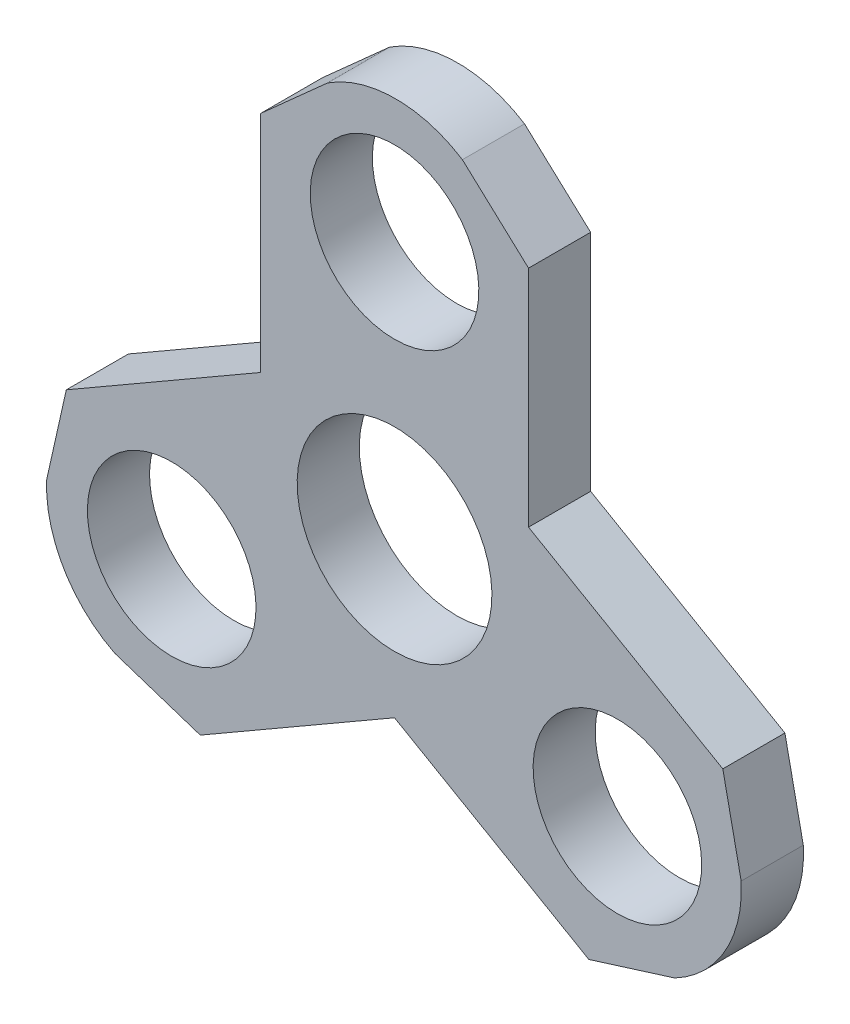
ISO-10303-21;
HEADER;
FILE_DESCRIPTION(('STEP AP214'),'2;1');
FILE_NAME('part.step','',(''),(''),'','','');
FILE_SCHEMA(('AUTOMOTIVE_DESIGN { 1 0 10303 214 1 1 1 1 }'));
ENDSEC;
DATA;
#1=APPLICATION_CONTEXT('core data for automotive mechanical design processes');
#2=APPLICATION_PROTOCOL_DEFINITION('international standard','automotive_design',2000,#1);
#3=PRODUCT_CONTEXT('',#1,'mechanical');
#4=PRODUCT('Part','Part','',(#3));
#5=PRODUCT_RELATED_PRODUCT_CATEGORY('part','',(#4));
#6=PRODUCT_DEFINITION_FORMATION('','',#4);
#7=PRODUCT_DEFINITION_CONTEXT('part definition',#1,'design');
#8=PRODUCT_DEFINITION('design','',#6,#7);
#9=PRODUCT_DEFINITION_SHAPE('','',#8);
#10=(LENGTH_UNIT() NAMED_UNIT(*) SI_UNIT(.MILLI.,.METRE.));
#11=(NAMED_UNIT(*) PLANE_ANGLE_UNIT() SI_UNIT($,.RADIAN.));
#12=(NAMED_UNIT(*) SI_UNIT($,.STERADIAN.) SOLID_ANGLE_UNIT());
#13=UNCERTAINTY_MEASURE_WITH_UNIT(LENGTH_MEASURE(1.E-05),#10,'distance_accuracy_value','');
#14=(GEOMETRIC_REPRESENTATION_CONTEXT(3) GLOBAL_UNCERTAINTY_ASSIGNED_CONTEXT((#13)) GLOBAL_UNIT_ASSIGNED_CONTEXT((#10,
#11,#12)) REPRESENTATION_CONTEXT('',''));
#15=CARTESIAN_POINT('',(0.,0.,0.));
#16=DIRECTION('',(0.,0.,1.));
#17=DIRECTION('',(1.,0.,0.));
#18=AXIS2_PLACEMENT_3D('',#15,#16,#17);
#19=CARTESIAN_POINT('',(-25.2223648236842,-17.3932095991333,-2.98513195330053));
#20=DIRECTION('',(0.,0.,-1.));
#21=DIRECTION('',(0.,1.,0.));
#22=AXIS2_PLACEMENT_3D('',#19,#20,#21);
#23=PLANE('',#22);
#24=DIRECTION('',(0.866025403784438,0.5,0.));
#25=VECTOR('',#24,1.);
#26=CARTESIAN_POINT('',(7.46668352147317E-12,-20.4211100828272,-2.98513195330054));
#27=LINE('',#26,#25);
#28=CARTESIAN_POINT('',(-21.8948637286672,-33.0621155504477,-2.98513195330058));
#29=VERTEX_POINT('',#28);
#30=CARTESIAN_POINT('',(7.46668352147317E-12,-20.4211100828272,-2.98513195330054));
#31=VERTEX_POINT('',#30);
#32=EDGE_CURVE('E203',#29,#31,#27,.T.);
#33=ORIENTED_EDGE('',*,*,#32,.T.);
#34=DIRECTION('',(0.866025403784439,-0.5,0.));
#35=VECTOR('',#34,1.);
#36=CARTESIAN_POINT('',(7.46668352147317E-12,-20.4211100828272,-2.98513195330054));
#37=LINE('',#36,#35);
#38=CARTESIAN_POINT('',(21.8948637286747,-33.0621155504433,-2.98513195330058));
#39=VERTEX_POINT('',#38);
#40=EDGE_CURVE('E116',#31,#39,#37,.T.);
#41=ORIENTED_EDGE('',*,*,#40,.T.);
#42=DIRECTION('',(0.954386697971061,0.298573325559894,0.));
#43=VECTOR('',#42,1.);
#44=CARTESIAN_POINT('',(21.8948637286747,-33.0621155504433,-2.98513195330058));
#45=LINE('',#44,#43);
#46=CARTESIAN_POINT('',(31.5628009791215,-30.0375677625216,-2.98513195330057));
#47=VERTEX_POINT('',#46);
#48=EDGE_CURVE('E239',#39,#47,#45,.T.);
#49=ORIENTED_EDGE('',*,*,#48,.T.);
#50=CARTESIAN_POINT('',(25.0889436728358,-17.6243018112157,-2.98513195330053));
#51=DIRECTION('',(0.,0.,1.));
#52=DIRECTION('',(0.,1.,0.));
#53=AXIS2_PLACEMENT_3D('',#50,#51,#52);
#54=CIRCLE('',#53,14.);
#55=CARTESIAN_POINT('',(39.0660590391427,-16.8241480529007,-2.98513195330052));
#56=VERTEX_POINT('',#55);
#57=EDGE_CURVE('E258',#47,#56,#54,.T.);
#58=ORIENTED_EDGE('',*,*,#57,.T.);
#59=DIRECTION('',(-0.204461531141964,0.97887459987635,0.));
#60=VECTOR('',#59,1.);
#61=CARTESIAN_POINT('',(36.9948637286747,-6.90814835615328,-2.98513195330049));
#62=LINE('',#61,#60);
#63=CARTESIAN_POINT('',(36.9948637286747,-6.90814835615328,-2.98513195330049));
#64=VERTEX_POINT('',#63);
#65=EDGE_CURVE('E255',#56,#64,#62,.T.);
#66=ORIENTED_EDGE('',*,*,#65,.T.);
#67=DIRECTION('',(-0.866025403784439,0.5,0.));
#68=VECTOR('',#67,1.);
#69=CARTESIAN_POINT('',(15.1,5.73285711146719,-2.98513195330045));
#70=LINE('',#69,#68);
#71=CARTESIAN_POINT('',(15.1,5.73285711146719,-2.98513195330045));
#72=VERTEX_POINT('',#71);
#73=EDGE_CURVE('E257',#64,#72,#70,.T.);
#74=ORIENTED_EDGE('',*,*,#73,.T.);
#75=DIRECTION('',(0.,1.,0.));
#76=VECTOR('',#75,1.);
#77=CARTESIAN_POINT('',(15.1,5.73285711146719,-2.98513195330045));
#78=LINE('',#77,#76);
#79=CARTESIAN_POINT('',(15.1,31.0148680466995,-2.98513195330036));
#80=VERTEX_POINT('',#79);
#81=EDGE_CURVE('E260',#72,#80,#78,.T.);
#82=ORIENTED_EDGE('',*,*,#81,.T.);
#83=DIRECTION('',(-0.735765433812801,0.677236462696938,0.));
#84=VECTOR('',#83,1.);
#85=CARTESIAN_POINT('',(15.1,31.0148680466995,-2.98513195330036));
#86=LINE('',#85,#84);
#87=CARTESIAN_POINT('',(7.64669615547633,37.8752734138195,-2.98513195330033));
#88=VERTEX_POINT('',#87);
#89=EDGE_CURVE('E266',#80,#88,#86,.T.);
#90=ORIENTED_EDGE('',*,*,#89,.T.);
#91=CARTESIAN_POINT('',(0.133421150855855,26.0621155504476,-2.98513195330037));
#92=DIRECTION('',(0.,0.,1.));
#93=DIRECTION('',(0.,1.,0.));
#94=AXIS2_PLACEMENT_3D('',#91,#92,#93);
#95=CIRCLE('',#94,14.);
#96=CARTESIAN_POINT('',(-7.548090013932,37.7665756501378,-2.98513195330033));
#97=VERTEX_POINT('',#96);
#98=EDGE_CURVE('E268',#88,#97,#95,.T.);
#99=ORIENTED_EDGE('',*,*,#98,.T.);
#100=DIRECTION('',(-0.745499505041264,-0.666506180003779,0.));
#101=VECTOR('',#100,1.);
#102=CARTESIAN_POINT('',(-15.1,31.0148680466995,-2.98513195330036));
#103=LINE('',#102,#101);
#104=CARTESIAN_POINT('',(-15.1,31.0148680466995,-2.98513195330036));
#105=VERTEX_POINT('',#104);
#106=EDGE_CURVE('E270',#97,#105,#103,.T.);
#107=ORIENTED_EDGE('',*,*,#106,.T.);
#108=DIRECTION('',(0.,-1.,0.));
#109=VECTOR('',#108,1.);
#110=CARTESIAN_POINT('',(-15.1,5.73285711145857,-2.98513195330045));
#111=LINE('',#110,#109);
#112=CARTESIAN_POINT('',(-15.1,5.73285711145857,-2.98513195330045));
#113=VERTEX_POINT('',#112);
#114=EDGE_CURVE('E272',#105,#113,#111,.T.);
#115=ORIENTED_EDGE('',*,*,#114,.T.);
#116=DIRECTION('',(-0.866025403784438,-0.5,0.));
#117=VECTOR('',#116,1.);
#118=CARTESIAN_POINT('',(-15.1,5.73285711145857,-2.98513195330045));
#119=LINE('',#118,#117);
#120=CARTESIAN_POINT('',(-36.9948637286672,-6.90814835615761,-2.98513195330049));
#121=VERTEX_POINT('',#120);
#122=EDGE_CURVE('E156',#113,#121,#119,.T.);
#123=ORIENTED_EDGE('',*,*,#122,.T.);
#124=DIRECTION('',(-0.21862126415826,-0.975809788256833,0.));
#125=VECTOR('',#124,1.);
#126=CARTESIAN_POINT('',(-36.9948637286672,-6.90814835615761,-2.98513195330049));
#127=LINE('',#126,#125);
#128=CARTESIAN_POINT('',(-39.2094971345904,-16.7931015111993,-2.98513195330052));
#129=VERTEX_POINT('',#128);
#130=EDGE_CURVE('E150',#121,#129,#127,.T.);
#131=ORIENTED_EDGE('',*,*,#130,.T.);
#132=CARTESIAN_POINT('',(-25.2223648236842,-17.3932095991333,-2.98513195330053));
#133=DIRECTION('',(0.,0.,1.));
#134=DIRECTION('',(0.,1.,0.));
#135=AXIS2_PLACEMENT_3D('',#132,#133,#134);
#136=CIRCLE('',#135,14.);
#137=CARTESIAN_POINT('',(-31.5179690252033,-29.8978234571385,-2.98513195330057));
#138=VERTEX_POINT('',#137);
#139=EDGE_CURVE('E154',#129,#138,#136,.T.);
#140=ORIENTED_EDGE('',*,*,#139,.T.);
#141=DIRECTION('',(0.949961036183229,-0.31236841987257,0.));
#142=VECTOR('',#141,1.);
#143=CARTESIAN_POINT('',(-21.8948637286672,-33.0621155504477,-2.98513195330058));
#144=LINE('',#143,#142);
#145=EDGE_CURVE('E52',#138,#29,#144,.T.);
#146=ORIENTED_EDGE('',*,*,#145,.T.);
#147=EDGE_LOOP('',(#33,#41,#49,#58,#66,#74,#82,#90,#99,#107,#115,#123,#131,#140,#146));
#148=FACE_BOUND('',#147,.T.);
#149=CARTESIAN_POINT('',(0.,-2.98513195330047,-2.98513195330048));
#150=DIRECTION('',(0.,0.,1.));
#151=DIRECTION('',(0.,-1.,0.));
#152=AXIS2_PLACEMENT_3D('',#149,#150,#151);
#153=CIRCLE('',#152,10.975);
#154=CARTESIAN_POINT('',(0.,-13.9601319533005,-2.98513195330051));
#155=VERTEX_POINT('',#154);
#156=EDGE_CURVE('E178',#155,#155,#153,.T.);
#157=ORIENTED_EDGE('',*,*,#156,.F.);
#158=EDGE_LOOP('',(#157));
#159=FACE_BOUND('',#158,.T.);
#160=CARTESIAN_POINT('',(0.,26.0148680466995,-2.98513195330037));
#161=DIRECTION('',(0.,0.,1.));
#162=DIRECTION('',(0.,-1.,0.));
#163=AXIS2_PLACEMENT_3D('',#160,#161,#162);
#164=CIRCLE('',#163,9.5);
#165=CARTESIAN_POINT('',(0.,16.5148680466995,-2.98513195330041));
#166=VERTEX_POINT('',#165);
#167=EDGE_CURVE('E336',#166,#166,#164,.T.);
#168=ORIENTED_EDGE('',*,*,#167,.F.);
#169=EDGE_LOOP('',(#168));
#170=FACE_BOUND('',#169,.T.);
#171=CARTESIAN_POINT('',(25.1147367097525,-17.4851319532983,-2.98513195330053));
#172=DIRECTION('',(0.,0.,1.));
#173=DIRECTION('',(0.,-1.,0.));
#174=AXIS2_PLACEMENT_3D('',#171,#172,#173);
#175=CIRCLE('',#174,9.5);
#176=CARTESIAN_POINT('',(25.1147367097525,-26.9851319532983,-2.98513195330056));
#177=VERTEX_POINT('',#176);
#178=EDGE_CURVE('E330',#177,#177,#175,.T.);
#179=ORIENTED_EDGE('',*,*,#178,.F.);
#180=EDGE_LOOP('',(#179));
#181=FACE_BOUND('',#180,.T.);
#182=CARTESIAN_POINT('',(-25.114736709745,-17.4851319533026,-2.98513195330053));
#183=DIRECTION('',(0.,0.,1.));
#184=DIRECTION('',(0.,-1.,0.));
#185=AXIS2_PLACEMENT_3D('',#182,#183,#184);
#186=CIRCLE('',#185,9.5);
#187=CARTESIAN_POINT('',(-25.114736709745,-26.9851319533026,-2.98513195330056));
#188=VERTEX_POINT('',#187);
#189=EDGE_CURVE('E321',#188,#188,#186,.T.);
#190=ORIENTED_EDGE('',*,*,#189,.F.);
#191=EDGE_LOOP('',(#190));
#192=FACE_BOUND('',#191,.T.);
#193=ADVANCED_FACE('F35',(#148,#159,#170,#181,#192),#23,.F.);
#194=CARTESIAN_POINT('',(-25.2223648236842,-17.3932095991333,-9.98513195330053));
#195=DIRECTION('',(0.,0.,-1.));
#196=DIRECTION('',(0.,1.,0.));
#197=AXIS2_PLACEMENT_3D('',#194,#195,#196);
#198=PLANE('',#197);
#199=CARTESIAN_POINT('',(25.1147367097525,-17.4851319532983,-9.98513195330053));
#200=DIRECTION('',(0.,0.,1.));
#201=DIRECTION('',(0.,-1.,0.));
#202=AXIS2_PLACEMENT_3D('',#199,#200,#201);
#203=CIRCLE('',#202,9.5);
#204=CARTESIAN_POINT('',(25.1147367097525,-26.9851319532983,-9.98513195330056));
#205=VERTEX_POINT('',#204);
#206=EDGE_CURVE('E327',#205,#205,#203,.T.);
#207=ORIENTED_EDGE('',*,*,#206,.T.);
#208=EDGE_LOOP('',(#207));
#209=FACE_BOUND('',#208,.T.);
#210=CARTESIAN_POINT('',(0.,-2.98513195330044,-9.98513195330048));
#211=DIRECTION('',(0.,0.,1.));
#212=DIRECTION('',(0.,-1.,0.));
#213=AXIS2_PLACEMENT_3D('',#210,#211,#212);
#214=CIRCLE('',#213,10.975);
#215=CARTESIAN_POINT('',(0.,-13.9601319533004,-9.98513195330051));
#216=VERTEX_POINT('',#215);
#217=EDGE_CURVE('E339',#216,#216,#214,.T.);
#218=ORIENTED_EDGE('',*,*,#217,.T.);
#219=EDGE_LOOP('',(#218));
#220=FACE_BOUND('',#219,.T.);
#221=DIRECTION('',(0.866025403784438,0.5,0.));
#222=VECTOR('',#221,1.);
#223=CARTESIAN_POINT('',(7.46668352147317E-12,-20.4211100828271,-9.98513195330054));
#224=LINE('',#223,#222);
#225=CARTESIAN_POINT('',(-21.8948637286672,-33.0621155504476,-9.98513195330058));
#226=VERTEX_POINT('',#225);
#227=CARTESIAN_POINT('',(7.46668352147317E-12,-20.4211100828271,-9.98513195330054));
#228=VERTEX_POINT('',#227);
#229=EDGE_CURVE('E174',#226,#228,#224,.T.);
#230=ORIENTED_EDGE('',*,*,#229,.F.);
#231=DIRECTION('',(0.949961036183229,-0.31236841987257,0.));
#232=VECTOR('',#231,1.);
#233=CARTESIAN_POINT('',(-21.8948637286672,-33.0621155504476,-9.98513195330058));
#234=LINE('',#233,#232);
#235=CARTESIAN_POINT('',(-31.5179690252033,-29.8978234571385,-9.98513195330057));
#236=VERTEX_POINT('',#235);
#237=EDGE_CURVE('E108',#236,#226,#234,.T.);
#238=ORIENTED_EDGE('',*,*,#237,.F.);
#239=CARTESIAN_POINT('',(-25.2223648236842,-17.3932095991333,-9.98513195330053));
#240=DIRECTION('',(0.,0.,1.));
#241=DIRECTION('',(0.,1.,0.));
#242=AXIS2_PLACEMENT_3D('',#239,#240,#241);
#243=CIRCLE('',#242,14.);
#244=CARTESIAN_POINT('',(-39.2094971345904,-16.7931015111993,-9.98513195330053));
#245=VERTEX_POINT('',#244);
#246=EDGE_CURVE('E102',#245,#236,#243,.T.);
#247=ORIENTED_EDGE('',*,*,#246,.F.);
#248=DIRECTION('',(-0.21862126415826,-0.975809788256833,0.));
#249=VECTOR('',#248,1.);
#250=CARTESIAN_POINT('',(-36.9948637286672,-6.90814835615759,-9.98513195330049));
#251=LINE('',#250,#249);
#252=CARTESIAN_POINT('',(-36.9948637286672,-6.90814835615759,-9.98513195330049));
#253=VERTEX_POINT('',#252);
#254=EDGE_CURVE('E164',#253,#245,#251,.T.);
#255=ORIENTED_EDGE('',*,*,#254,.F.);
#256=DIRECTION('',(-0.866025403784438,-0.5,0.));
#257=VECTOR('',#256,1.);
#258=CARTESIAN_POINT('',(-15.1,5.7328571114586,-9.98513195330045));
#259=LINE('',#258,#257);
#260=CARTESIAN_POINT('',(-15.1,5.7328571114586,-9.98513195330045));
#261=VERTEX_POINT('',#260);
#262=EDGE_CURVE('E198',#261,#253,#259,.T.);
#263=ORIENTED_EDGE('',*,*,#262,.F.);
#264=DIRECTION('',(0.,-1.,0.));
#265=VECTOR('',#264,1.);
#266=CARTESIAN_POINT('',(-15.1,5.7328571114586,-9.98513195330045));
#267=LINE('',#266,#265);
#268=CARTESIAN_POINT('',(-15.1,31.0148680466996,-9.98513195330036));
#269=VERTEX_POINT('',#268);
#270=EDGE_CURVE('E196',#269,#261,#267,.T.);
#271=ORIENTED_EDGE('',*,*,#270,.F.);
#272=DIRECTION('',(-0.745499505041264,-0.666506180003779,0.));
#273=VECTOR('',#272,1.);
#274=CARTESIAN_POINT('',(-15.1,31.0148680466996,-9.98513195330036));
#275=LINE('',#274,#273);
#276=CARTESIAN_POINT('',(-7.548090013932,37.7665756501378,-9.98513195330033));
#277=VERTEX_POINT('',#276);
#278=EDGE_CURVE('E194',#277,#269,#275,.T.);
#279=ORIENTED_EDGE('',*,*,#278,.F.);
#280=CARTESIAN_POINT('',(0.133421150855855,26.0621155504477,-9.98513195330038));
#281=DIRECTION('',(0.,0.,1.));
#282=DIRECTION('',(0.,1.,0.));
#283=AXIS2_PLACEMENT_3D('',#280,#281,#282);
#284=CIRCLE('',#283,14.);
#285=CARTESIAN_POINT('',(7.64669615547633,37.8752734138195,-9.98513195330033));
#286=VERTEX_POINT('',#285);
#287=EDGE_CURVE('E192',#286,#277,#284,.T.);
#288=ORIENTED_EDGE('',*,*,#287,.F.);
#289=DIRECTION('',(-0.735765433812801,0.677236462696938,0.));
#290=VECTOR('',#289,1.);
#291=CARTESIAN_POINT('',(15.1,31.0148680466996,-9.98513195330036));
#292=LINE('',#291,#290);
#293=CARTESIAN_POINT('',(15.1,31.0148680466996,-9.98513195330036));
#294=VERTEX_POINT('',#293);
#295=EDGE_CURVE('E190',#294,#286,#292,.T.);
#296=ORIENTED_EDGE('',*,*,#295,.F.);
#297=DIRECTION('',(0.,1.,0.));
#298=VECTOR('',#297,1.);
#299=CARTESIAN_POINT('',(15.1,5.73285711146722,-9.98513195330045));
#300=LINE('',#299,#298);
#301=CARTESIAN_POINT('',(15.1,5.73285711146722,-9.98513195330045));
#302=VERTEX_POINT('',#301);
#303=EDGE_CURVE('E188',#302,#294,#300,.T.);
#304=ORIENTED_EDGE('',*,*,#303,.F.);
#305=DIRECTION('',(-0.866025403784439,0.5,0.));
#306=VECTOR('',#305,1.);
#307=CARTESIAN_POINT('',(15.1,5.73285711146722,-9.98513195330045));
#308=LINE('',#307,#306);
#309=CARTESIAN_POINT('',(36.9948637286747,-6.90814835615325,-9.98513195330049));
#310=VERTEX_POINT('',#309);
#311=EDGE_CURVE('E186',#310,#302,#308,.T.);
#312=ORIENTED_EDGE('',*,*,#311,.F.);
#313=DIRECTION('',(-0.204461531141964,0.97887459987635,0.));
#314=VECTOR('',#313,1.);
#315=CARTESIAN_POINT('',(36.9948637286747,-6.90814835615325,-9.98513195330049));
#316=LINE('',#315,#314);
#317=CARTESIAN_POINT('',(39.0660590391427,-16.8241480529007,-9.98513195330053));
#318=VERTEX_POINT('',#317);
#319=EDGE_CURVE('E184',#318,#310,#316,.T.);
#320=ORIENTED_EDGE('',*,*,#319,.F.);
#321=CARTESIAN_POINT('',(25.0889436728358,-17.6243018112157,-9.98513195330053));
#322=DIRECTION('',(0.,0.,1.));
#323=DIRECTION('',(0.,1.,0.));
#324=AXIS2_PLACEMENT_3D('',#321,#322,#323);
#325=CIRCLE('',#324,14.);
#326=CARTESIAN_POINT('',(31.5628009791215,-30.0375677625216,-9.98513195330057));
#327=VERTEX_POINT('',#326);
#328=EDGE_CURVE('E182',#327,#318,#325,.T.);
#329=ORIENTED_EDGE('',*,*,#328,.F.);
#330=DIRECTION('',(0.954386697971061,0.298573325559894,0.));
#331=VECTOR('',#330,1.);
#332=CARTESIAN_POINT('',(21.8948637286747,-33.0621155504433,-9.98513195330058));
#333=LINE('',#332,#331);
#334=CARTESIAN_POINT('',(21.8948637286747,-33.0621155504433,-9.98513195330058));
#335=VERTEX_POINT('',#334);
#336=EDGE_CURVE('E180',#335,#327,#333,.T.);
#337=ORIENTED_EDGE('',*,*,#336,.F.);
#338=DIRECTION('',(0.866025403784439,-0.5,0.));
#339=VECTOR('',#338,1.);
#340=CARTESIAN_POINT('',(7.46668352147317E-12,-20.4211100828271,-9.98513195330054));
#341=LINE('',#340,#339);
#342=EDGE_CURVE('E177',#228,#335,#341,.T.);
#343=ORIENTED_EDGE('',*,*,#342,.F.);
#344=EDGE_LOOP('',(#230,#238,#247,#255,#263,#271,#279,#288,#296,#304,#312,#320,#329,#337,#343));
#345=FACE_BOUND('',#344,.T.);
#346=CARTESIAN_POINT('',(0.,26.0148680466996,-9.98513195330038));
#347=DIRECTION('',(0.,0.,1.));
#348=DIRECTION('',(0.,-1.,0.));
#349=AXIS2_PLACEMENT_3D('',#346,#347,#348);
#350=CIRCLE('',#349,9.5);
#351=CARTESIAN_POINT('',(0.,16.5148680466996,-9.98513195330041));
#352=VERTEX_POINT('',#351);
#353=EDGE_CURVE('E333',#352,#352,#350,.T.);
#354=ORIENTED_EDGE('',*,*,#353,.T.);
#355=EDGE_LOOP('',(#354));
#356=FACE_BOUND('',#355,.T.);
#357=CARTESIAN_POINT('',(-25.114736709745,-17.4851319533026,-9.98513195330053));
#358=DIRECTION('',(0.,0.,1.));
#359=DIRECTION('',(0.,-1.,0.));
#360=AXIS2_PLACEMENT_3D('',#357,#358,#359);
#361=CIRCLE('',#360,9.5);
#362=CARTESIAN_POINT('',(-25.114736709745,-26.9851319533026,-9.98513195330056));
#363=VERTEX_POINT('',#362);
#364=EDGE_CURVE('E324',#363,#363,#361,.T.);
#365=ORIENTED_EDGE('',*,*,#364,.T.);
#366=EDGE_LOOP('',(#365));
#367=FACE_BOUND('',#366,.T.);
#368=ADVANCED_FACE('F243',(#209,#220,#345,#356,#367),#198,.T.);
#369=CARTESIAN_POINT('',(7.46668352147317E-12,-20.4211100828272,-2.98513195330054));
#370=DIRECTION('',(-0.5,0.866025403784438,0.));
#371=DIRECTION('',(-0.866025403784438,-0.5,0.));
#372=AXIS2_PLACEMENT_3D('',#369,#370,#371);
#373=PLANE('',#372);
#374=ORIENTED_EDGE('',*,*,#229,.T.);
#375=DIRECTION('',(0.,0.,-1.));
#376=VECTOR('',#375,1.);
#377=CARTESIAN_POINT('',(7.46668352147317E-12,-20.4211100828272,-2.98513195330054));
#378=LINE('',#377,#376);
#379=EDGE_CURVE('E11',#31,#228,#378,.T.);
#380=ORIENTED_EDGE('',*,*,#379,.F.);
#381=ORIENTED_EDGE('',*,*,#32,.F.);
#382=DIRECTION('',(0.,0.,-1.));
#383=VECTOR('',#382,1.);
#384=CARTESIAN_POINT('',(-21.8948637286672,-33.0621155504477,-2.98513195330058));
#385=LINE('',#384,#383);
#386=EDGE_CURVE('E170',#29,#226,#385,.T.);
#387=ORIENTED_EDGE('',*,*,#386,.T.);
#388=EDGE_LOOP('',(#374,#380,#381,#387));
#389=FACE_BOUND('',#388,.T.);
#390=ADVANCED_FACE('F37',(#389),#373,.F.);
#391=CARTESIAN_POINT('',(7.46668352147317E-12,-20.4211100828272,-2.98513195330054));
#392=DIRECTION('',(0.5,0.866025403784439,0.));
#393=DIRECTION('',(-0.866025403784439,0.5,0.));
#394=AXIS2_PLACEMENT_3D('',#391,#392,#393);
#395=PLANE('',#394);
#396=ORIENTED_EDGE('',*,*,#342,.T.);
#397=DIRECTION('',(0.,0.,-1.));
#398=VECTOR('',#397,1.);
#399=CARTESIAN_POINT('',(21.8948637286747,-33.0621155504433,-2.98513195330058));
#400=LINE('',#399,#398);
#401=EDGE_CURVE('E44',#39,#335,#400,.T.);
#402=ORIENTED_EDGE('',*,*,#401,.F.);
#403=ORIENTED_EDGE('',*,*,#40,.F.);
#404=ORIENTED_EDGE('',*,*,#379,.T.);
#405=EDGE_LOOP('',(#396,#402,#403,#404));
#406=FACE_BOUND('',#405,.T.);
#407=ADVANCED_FACE('F482',(#406),#395,.F.);
#408=CARTESIAN_POINT('',(21.8948637286747,-33.0621155504433,-2.98513195330058));
#409=DIRECTION('',(-0.298573325559894,0.954386697971061,0.));
#410=DIRECTION('',(-0.954386697971061,-0.298573325559894,0.));
#411=AXIS2_PLACEMENT_3D('',#408,#409,#410);
#412=PLANE('',#411);
#413=ORIENTED_EDGE('',*,*,#336,.T.);
#414=DIRECTION('',(0.,0.,-1.));
#415=VECTOR('',#414,1.);
#416=CARTESIAN_POINT('',(31.5628009791215,-30.0375677625216,-2.98513195330057));
#417=LINE('',#416,#415);
#418=EDGE_CURVE('E231',#47,#327,#417,.T.);
#419=ORIENTED_EDGE('',*,*,#418,.F.);
#420=ORIENTED_EDGE('',*,*,#48,.F.);
#421=ORIENTED_EDGE('',*,*,#401,.T.);
#422=EDGE_LOOP('',(#413,#419,#420,#421));
#423=FACE_BOUND('',#422,.T.);
#424=ADVANCED_FACE('F237',(#423),#412,.F.);
#425=CARTESIAN_POINT('',(25.0889436728358,-17.6243018112157,-2.98513195330053));
#426=DIRECTION('',(0.,0.,-1.));
#427=DIRECTION('',(0.,1.,0.));
#428=AXIS2_PLACEMENT_3D('',#425,#426,#427);
#429=CYLINDRICAL_SURFACE('',#428,14.);
#430=ORIENTED_EDGE('',*,*,#328,.T.);
#431=DIRECTION('',(0.,0.,-1.));
#432=VECTOR('',#431,1.);
#433=CARTESIAN_POINT('',(39.0660590391427,-16.8241480529007,-2.98513195330052));
#434=LINE('',#433,#432);
#435=EDGE_CURVE('E228',#56,#318,#434,.T.);
#436=ORIENTED_EDGE('',*,*,#435,.F.);
#437=ORIENTED_EDGE('',*,*,#57,.F.);
#438=ORIENTED_EDGE('',*,*,#418,.T.);
#439=EDGE_LOOP('',(#430,#436,#437,#438));
#440=FACE_BOUND('',#439,.T.);
#441=ADVANCED_FACE('F249',(#440),#429,.T.);
#442=CARTESIAN_POINT('',(36.9948637286747,-6.90814835615328,-2.98513195330049));
#443=DIRECTION('',(-0.97887459987635,-0.204461531141964,0.));
#444=DIRECTION('',(0.204461531141964,-0.97887459987635,0.));
#445=AXIS2_PLACEMENT_3D('',#442,#443,#444);
#446=PLANE('',#445);
#447=ORIENTED_EDGE('',*,*,#319,.T.);
#448=DIRECTION('',(0.,0.,-1.));
#449=VECTOR('',#448,1.);
#450=CARTESIAN_POINT('',(36.9948637286747,-6.90814835615328,-2.98513195330049));
#451=LINE('',#450,#449);
#452=EDGE_CURVE('E225',#64,#310,#451,.T.);
#453=ORIENTED_EDGE('',*,*,#452,.F.);
#454=ORIENTED_EDGE('',*,*,#65,.F.);
#455=ORIENTED_EDGE('',*,*,#435,.T.);
#456=EDGE_LOOP('',(#447,#453,#454,#455));
#457=FACE_BOUND('',#456,.T.);
#458=ADVANCED_FACE('F253',(#457),#446,.F.);
#459=CARTESIAN_POINT('',(15.1,5.73285711146719,-2.98513195330045));
#460=DIRECTION('',(-0.5,-0.866025403784439,0.));
#461=DIRECTION('',(0.866025403784439,-0.5,0.));
#462=AXIS2_PLACEMENT_3D('',#459,#460,#461);
#463=PLANE('',#462);
#464=ORIENTED_EDGE('',*,*,#311,.T.);
#465=DIRECTION('',(0.,0.,-1.));
#466=VECTOR('',#465,1.);
#467=CARTESIAN_POINT('',(15.1,5.73285711146719,-2.98513195330045));
#468=LINE('',#467,#466);
#469=EDGE_CURVE('E222',#72,#302,#468,.T.);
#470=ORIENTED_EDGE('',*,*,#469,.F.);
#471=ORIENTED_EDGE('',*,*,#73,.F.);
#472=ORIENTED_EDGE('',*,*,#452,.T.);
#473=EDGE_LOOP('',(#464,#470,#471,#472));
#474=FACE_BOUND('',#473,.T.);
#475=ADVANCED_FACE('F447',(#474),#463,.F.);
#476=CARTESIAN_POINT('',(15.1,5.73285711146719,-2.98513195330045));
#477=DIRECTION('',(-1.,0.,0.));
#478=DIRECTION('',(0.,-1.,0.));
#479=AXIS2_PLACEMENT_3D('',#476,#477,#478);
#480=PLANE('',#479);
#481=ORIENTED_EDGE('',*,*,#303,.T.);
#482=DIRECTION('',(0.,0.,-1.));
#483=VECTOR('',#482,1.);
#484=CARTESIAN_POINT('',(15.1,31.0148680466995,-2.98513195330036));
#485=LINE('',#484,#483);
#486=EDGE_CURVE('E219',#80,#294,#485,.T.);
#487=ORIENTED_EDGE('',*,*,#486,.F.);
#488=ORIENTED_EDGE('',*,*,#81,.F.);
#489=ORIENTED_EDGE('',*,*,#469,.T.);
#490=EDGE_LOOP('',(#481,#487,#488,#489));
#491=FACE_BOUND('',#490,.T.);
#492=ADVANCED_FACE('F437',(#491),#480,.F.);
#493=CARTESIAN_POINT('',(15.1,31.0148680466995,-2.98513195330036));
#494=DIRECTION('',(-0.677236462696938,-0.735765433812801,0.));
#495=DIRECTION('',(0.735765433812801,-0.677236462696938,0.));
#496=AXIS2_PLACEMENT_3D('',#493,#494,#495);
#497=PLANE('',#496);
#498=ORIENTED_EDGE('',*,*,#295,.T.);
#499=DIRECTION('',(0.,0.,-1.));
#500=VECTOR('',#499,1.);
#501=CARTESIAN_POINT('',(7.64669615547633,37.8752734138195,-2.98513195330033));
#502=LINE('',#501,#500);
#503=EDGE_CURVE('E216',#88,#286,#502,.T.);
#504=ORIENTED_EDGE('',*,*,#503,.F.);
#505=ORIENTED_EDGE('',*,*,#89,.F.);
#506=ORIENTED_EDGE('',*,*,#486,.T.);
#507=EDGE_LOOP('',(#498,#504,#505,#506));
#508=FACE_BOUND('',#507,.T.);
#509=ADVANCED_FACE('F427',(#508),#497,.F.);
#510=CARTESIAN_POINT('',(0.133421150855855,26.0621155504476,-2.98513195330037));
#511=DIRECTION('',(0.,0.,-1.));
#512=DIRECTION('',(0.,1.,0.));
#513=AXIS2_PLACEMENT_3D('',#510,#511,#512);
#514=CYLINDRICAL_SURFACE('',#513,14.);
#515=ORIENTED_EDGE('',*,*,#287,.T.);
#516=DIRECTION('',(0.,0.,-1.));
#517=VECTOR('',#516,1.);
#518=CARTESIAN_POINT('',(-7.548090013932,37.7665756501378,-2.98513195330033));
#519=LINE('',#518,#517);
#520=EDGE_CURVE('E213',#97,#277,#519,.T.);
#521=ORIENTED_EDGE('',*,*,#520,.F.);
#522=ORIENTED_EDGE('',*,*,#98,.F.);
#523=ORIENTED_EDGE('',*,*,#503,.T.);
#524=EDGE_LOOP('',(#515,#521,#522,#523));
#525=FACE_BOUND('',#524,.T.);
#526=ADVANCED_FACE('F417',(#525),#514,.T.);
#527=CARTESIAN_POINT('',(-15.1,31.0148680466995,-2.98513195330036));
#528=DIRECTION('',(0.666506180003779,-0.745499505041264,0.));
#529=DIRECTION('',(0.745499505041264,0.666506180003779,0.));
#530=AXIS2_PLACEMENT_3D('',#527,#528,#529);
#531=PLANE('',#530);
#532=ORIENTED_EDGE('',*,*,#278,.T.);
#533=DIRECTION('',(0.,0.,-1.));
#534=VECTOR('',#533,1.);
#535=CARTESIAN_POINT('',(-15.1,31.0148680466995,-2.98513195330036));
#536=LINE('',#535,#534);
#537=EDGE_CURVE('E210',#105,#269,#536,.T.);
#538=ORIENTED_EDGE('',*,*,#537,.F.);
#539=ORIENTED_EDGE('',*,*,#106,.F.);
#540=ORIENTED_EDGE('',*,*,#520,.T.);
#541=EDGE_LOOP('',(#532,#538,#539,#540));
#542=FACE_BOUND('',#541,.T.);
#543=ADVANCED_FACE('F408',(#542),#531,.F.);
#544=CARTESIAN_POINT('',(-15.1,5.73285711145857,-2.98513195330045));
#545=DIRECTION('',(1.,0.,0.));
#546=DIRECTION('',(0.,1.,0.));
#547=AXIS2_PLACEMENT_3D('',#544,#545,#546);
#548=PLANE('',#547);
#549=ORIENTED_EDGE('',*,*,#270,.T.);
#550=DIRECTION('',(0.,0.,-1.));
#551=VECTOR('',#550,1.);
#552=CARTESIAN_POINT('',(-15.1,5.73285711145857,-2.98513195330045));
#553=LINE('',#552,#551);
#554=EDGE_CURVE('E207',#113,#261,#553,.T.);
#555=ORIENTED_EDGE('',*,*,#554,.F.);
#556=ORIENTED_EDGE('',*,*,#114,.F.);
#557=ORIENTED_EDGE('',*,*,#537,.T.);
#558=EDGE_LOOP('',(#549,#555,#556,#557));
#559=FACE_BOUND('',#558,.T.);
#560=ADVANCED_FACE('F278',(#559),#548,.F.);
#561=CARTESIAN_POINT('',(-15.1,5.73285711145857,-2.98513195330045));
#562=DIRECTION('',(0.5,-0.866025403784438,0.));
#563=DIRECTION('',(0.866025403784438,0.5,0.));
#564=AXIS2_PLACEMENT_3D('',#561,#562,#563);
#565=PLANE('',#564);
#566=ORIENTED_EDGE('',*,*,#262,.T.);
#567=DIRECTION('',(0.,0.,-1.));
#568=VECTOR('',#567,1.);
#569=CARTESIAN_POINT('',(-36.9948637286672,-6.90814835615761,-2.98513195330049));
#570=LINE('',#569,#568);
#571=EDGE_CURVE('E165',#121,#253,#570,.T.);
#572=ORIENTED_EDGE('',*,*,#571,.F.);
#573=ORIENTED_EDGE('',*,*,#122,.F.);
#574=ORIENTED_EDGE('',*,*,#554,.T.);
#575=EDGE_LOOP('',(#566,#572,#573,#574));
#576=FACE_BOUND('',#575,.T.);
#577=ADVANCED_FACE('F282',(#576),#565,.F.);
#578=CARTESIAN_POINT('',(-36.9948637286672,-6.90814835615761,-2.98513195330049));
#579=DIRECTION('',(0.975809788256833,-0.21862126415826,0.));
#580=DIRECTION('',(0.21862126415826,0.975809788256833,0.));
#581=AXIS2_PLACEMENT_3D('',#578,#579,#580);
#582=PLANE('',#581);
#583=ORIENTED_EDGE('',*,*,#254,.T.);
#584=DIRECTION('',(0.,0.,-1.));
#585=VECTOR('',#584,1.);
#586=CARTESIAN_POINT('',(-39.2094971345904,-16.7931015111993,-2.98513195330052));
#587=LINE('',#586,#585);
#588=EDGE_CURVE('E161',#129,#245,#587,.T.);
#589=ORIENTED_EDGE('',*,*,#588,.F.);
#590=ORIENTED_EDGE('',*,*,#130,.F.);
#591=ORIENTED_EDGE('',*,*,#571,.T.);
#592=EDGE_LOOP('',(#583,#589,#590,#591));
#593=FACE_BOUND('',#592,.T.);
#594=ADVANCED_FACE('F162',(#593),#582,.F.);
#595=CARTESIAN_POINT('',(-25.2223648236842,-17.3932095991333,-2.98513195330053));
#596=DIRECTION('',(0.,0.,-1.));
#597=DIRECTION('',(0.,1.,0.));
#598=AXIS2_PLACEMENT_3D('',#595,#596,#597);
#599=CYLINDRICAL_SURFACE('',#598,14.);
#600=ORIENTED_EDGE('',*,*,#246,.T.);
#601=DIRECTION('',(0.,0.,-1.));
#602=VECTOR('',#601,1.);
#603=CARTESIAN_POINT('',(-31.5179690252033,-29.8978234571385,-2.98513195330057));
#604=LINE('',#603,#602);
#605=EDGE_CURVE('E166',#138,#236,#604,.T.);
#606=ORIENTED_EDGE('',*,*,#605,.F.);
#607=ORIENTED_EDGE('',*,*,#139,.F.);
#608=ORIENTED_EDGE('',*,*,#588,.T.);
#609=EDGE_LOOP('',(#600,#606,#607,#608));
#610=FACE_BOUND('',#609,.T.);
#611=ADVANCED_FACE('F168',(#610),#599,.T.);
#612=CARTESIAN_POINT('',(-21.8948637286672,-33.0621155504477,-2.98513195330058));
#613=DIRECTION('',(0.31236841987257,0.949961036183229,0.));
#614=DIRECTION('',(-0.949961036183229,0.31236841987257,0.));
#615=AXIS2_PLACEMENT_3D('',#612,#613,#614);
#616=PLANE('',#615);
#617=ORIENTED_EDGE('',*,*,#237,.T.);
#618=ORIENTED_EDGE('',*,*,#386,.F.);
#619=ORIENTED_EDGE('',*,*,#145,.F.);
#620=ORIENTED_EDGE('',*,*,#605,.T.);
#621=EDGE_LOOP('',(#617,#618,#619,#620));
#622=FACE_BOUND('',#621,.T.);
#623=ADVANCED_FACE('F286',(#622),#616,.F.);
#624=CARTESIAN_POINT('',(0.,-2.98513195330047,-2.98513195330048));
#625=DIRECTION('',(0.,0.,-1.));
#626=DIRECTION('',(0.,1.,0.));
#627=AXIS2_PLACEMENT_3D('',#624,#625,#626);
#628=CYLINDRICAL_SURFACE('',#627,10.975);
#629=ORIENTED_EDGE('',*,*,#156,.T.);
#630=EDGE_LOOP('',(#629));
#631=FACE_BOUND('',#630,.T.);
#632=ORIENTED_EDGE('',*,*,#217,.F.);
#633=EDGE_LOOP('',(#632));
#634=FACE_BOUND('',#633,.T.);
#635=ADVANCED_FACE('F288',(#631,#634),#628,.F.);
#636=CARTESIAN_POINT('',(0.,26.0148680466995,-2.98513195330037));
#637=DIRECTION('',(0.,0.,-1.));
#638=DIRECTION('',(0.,1.,0.));
#639=AXIS2_PLACEMENT_3D('',#636,#637,#638);
#640=CYLINDRICAL_SURFACE('',#639,9.5);
#641=ORIENTED_EDGE('',*,*,#167,.T.);
#642=EDGE_LOOP('',(#641));
#643=FACE_BOUND('',#642,.T.);
#644=ORIENTED_EDGE('',*,*,#353,.F.);
#645=EDGE_LOOP('',(#644));
#646=FACE_BOUND('',#645,.T.);
#647=ADVANCED_FACE('F294',(#643,#646),#640,.F.);
#648=CARTESIAN_POINT('',(25.1147367097525,-17.4851319532983,-2.98513195330053));
#649=DIRECTION('',(0.,0.,-1.));
#650=DIRECTION('',(0.,1.,0.));
#651=AXIS2_PLACEMENT_3D('',#648,#649,#650);
#652=CYLINDRICAL_SURFACE('',#651,9.5);
#653=ORIENTED_EDGE('',*,*,#178,.T.);
#654=EDGE_LOOP('',(#653));
#655=FACE_BOUND('',#654,.T.);
#656=ORIENTED_EDGE('',*,*,#206,.F.);
#657=EDGE_LOOP('',(#656));
#658=FACE_BOUND('',#657,.T.);
#659=ADVANCED_FACE('F308',(#655,#658),#652,.F.);
#660=CARTESIAN_POINT('',(-25.114736709745,-17.4851319533026,-2.98513195330053));
#661=DIRECTION('',(0.,0.,-1.));
#662=DIRECTION('',(0.,1.,0.));
#663=AXIS2_PLACEMENT_3D('',#660,#661,#662);
#664=CYLINDRICAL_SURFACE('',#663,9.5);
#665=ORIENTED_EDGE('',*,*,#189,.T.);
#666=EDGE_LOOP('',(#665));
#667=FACE_BOUND('',#666,.T.);
#668=ORIENTED_EDGE('',*,*,#364,.F.);
#669=EDGE_LOOP('',(#668));
#670=FACE_BOUND('',#669,.T.);
#671=ADVANCED_FACE('F312',(#667,#670),#664,.F.);
#672=CLOSED_SHELL('',(#193,#368,#390,#407,#424,#441,#458,#475,#492,#509,#526,#543,#560,#577,
#594,#611,#623,#635,#647,#659,#671));
#673=MANIFOLD_SOLID_BREP('B2',#672);
#674=ADVANCED_BREP_SHAPE_REPRESENTATION('',(#18,#673),#14);
#675=SHAPE_DEFINITION_REPRESENTATION(#9,#674);
ENDSEC;
END-ISO-10303-21;
